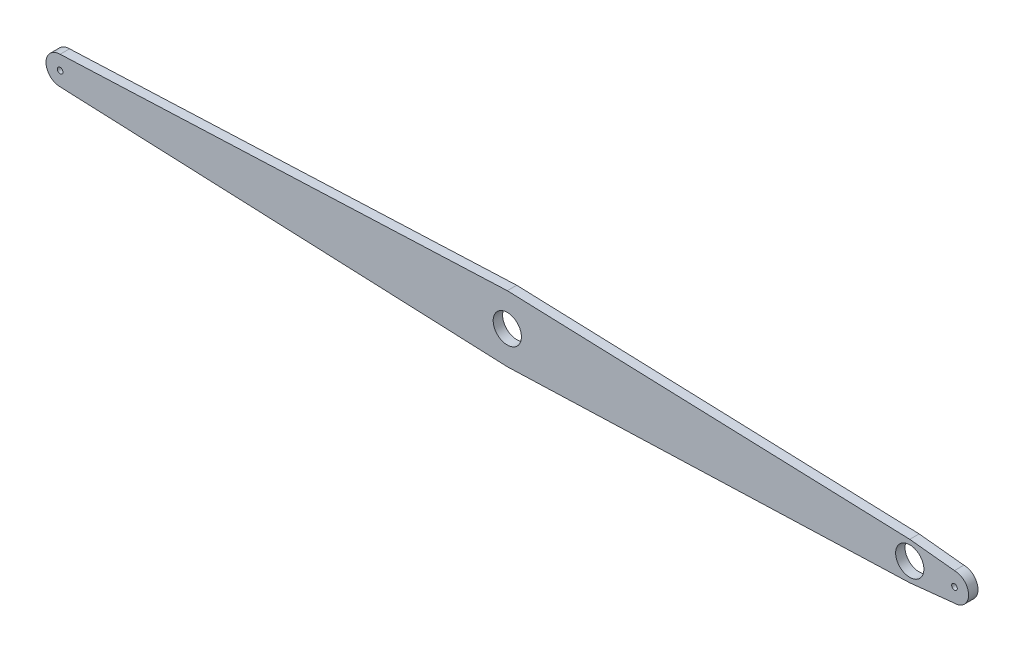
ISO-10303-21;
HEADER;
FILE_DESCRIPTION(('STEP AP214'),'2;1');
FILE_NAME('part.step','',(''),(''),'','','');
FILE_SCHEMA(('AUTOMOTIVE_DESIGN { 1 0 10303 214 1 1 1 1 }'));
ENDSEC;
DATA;
#1=APPLICATION_CONTEXT('core data for automotive mechanical design processes');
#2=APPLICATION_PROTOCOL_DEFINITION('international standard','automotive_design',2000,#1);
#3=PRODUCT_CONTEXT('',#1,'mechanical');
#4=PRODUCT('Part','Part','',(#3));
#5=PRODUCT_RELATED_PRODUCT_CATEGORY('part','',(#4));
#6=PRODUCT_DEFINITION_FORMATION('','',#4);
#7=PRODUCT_DEFINITION_CONTEXT('part definition',#1,'design');
#8=PRODUCT_DEFINITION('design','',#6,#7);
#9=PRODUCT_DEFINITION_SHAPE('','',#8);
#10=(LENGTH_UNIT() NAMED_UNIT(*) SI_UNIT(.MILLI.,.METRE.));
#11=(NAMED_UNIT(*) PLANE_ANGLE_UNIT() SI_UNIT($,.RADIAN.));
#12=(NAMED_UNIT(*) SI_UNIT($,.STERADIAN.) SOLID_ANGLE_UNIT());
#13=UNCERTAINTY_MEASURE_WITH_UNIT(LENGTH_MEASURE(1.E-05),#10,'distance_accuracy_value','');
#14=(GEOMETRIC_REPRESENTATION_CONTEXT(3) GLOBAL_UNCERTAINTY_ASSIGNED_CONTEXT((#13)) GLOBAL_UNIT_ASSIGNED_CONTEXT((#10,
#11,#12)) REPRESENTATION_CONTEXT('',''));
#15=CARTESIAN_POINT('',(0.,0.,0.));
#16=DIRECTION('',(0.,0.,1.));
#17=DIRECTION('',(1.,0.,0.));
#18=AXIS2_PLACEMENT_3D('',#15,#16,#17);
#19=CARTESIAN_POINT('',(-1900.,0.,20.));
#20=DIRECTION('',(0.,0.,-1.));
#21=DIRECTION('',(-1.,0.,0.));
#22=AXIS2_PLACEMENT_3D('',#19,#20,#21);
#23=PLANE('',#22);
#24=CARTESIAN_POINT('',(-1900.,0.,20.));
#25=DIRECTION('',(0.,0.,1.));
#26=DIRECTION('',(-1.,0.,0.));
#27=AXIS2_PLACEMENT_3D('',#24,#25,#26);
#28=CIRCLE('',#27,29.9999999999998);
#29=CARTESIAN_POINT('',(-1900.,29.9999999999995,20.));
#30=VERTEX_POINT('',#29);
#31=CARTESIAN_POINT('',(-1900.,-30.,20.));
#32=VERTEX_POINT('',#31);
#33=EDGE_CURVE('E157',#30,#32,#28,.T.);
#34=ORIENTED_EDGE('',*,*,#33,.T.);
#35=DIRECTION('',(0.999114750296777,-0.0420679894861799,0.));
#36=VECTOR('',#35,1.);
#37=CARTESIAN_POINT('',(-1900.,-30.,20.));
#38=LINE('',#37,#36);
#39=CARTESIAN_POINT('',(-950.,-69.9999999999999,20.));
#40=VERTEX_POINT('',#39);
#41=EDGE_CURVE('E105',#32,#40,#38,.T.);
#42=ORIENTED_EDGE('',*,*,#41,.T.);
#43=DIRECTION('',(0.999384993791767,0.0350661401330443,0.));
#44=VECTOR('',#43,1.);
#45=CARTESIAN_POINT('',(-950.,-69.9999999999999,20.));
#46=LINE('',#45,#44);
#47=CARTESIAN_POINT('',(-95.,-40.,20.));
#48=VERTEX_POINT('',#47);
#49=EDGE_CURVE('E172',#40,#48,#46,.T.);
#50=ORIENTED_EDGE('',*,*,#49,.T.);
#51=DIRECTION('',(0.994505452921406,0.104684784518043,0.));
#52=VECTOR('',#51,1.);
#53=CARTESIAN_POINT('',(-95.,-40.,20.));
#54=LINE('',#53,#52);
#55=CARTESIAN_POINT('',(0.,-30.,20.));
#56=VERTEX_POINT('',#55);
#57=EDGE_CURVE('E185',#48,#56,#54,.T.);
#58=ORIENTED_EDGE('',*,*,#57,.T.);
#59=CARTESIAN_POINT('',(0.,0.,20.));
#60=DIRECTION('',(0.,0.,1.));
#61=DIRECTION('',(1.,0.,0.));
#62=AXIS2_PLACEMENT_3D('',#59,#60,#61);
#63=CIRCLE('',#62,30.);
#64=CARTESIAN_POINT('',(0.,30.,20.));
#65=VERTEX_POINT('',#64);
#66=EDGE_CURVE('E124',#56,#65,#63,.T.);
#67=ORIENTED_EDGE('',*,*,#66,.T.);
#68=DIRECTION('',(-0.994505452921406,0.104684784518043,0.));
#69=VECTOR('',#68,1.);
#70=CARTESIAN_POINT('',(-95.,40.,20.));
#71=LINE('',#70,#69);
#72=CARTESIAN_POINT('',(-95.,40.,20.));
#73=VERTEX_POINT('',#72);
#74=EDGE_CURVE('E118',#65,#73,#71,.T.);
#75=ORIENTED_EDGE('',*,*,#74,.T.);
#76=DIRECTION('',(-0.999384993791767,0.0350661401330443,0.));
#77=VECTOR('',#76,1.);
#78=CARTESIAN_POINT('',(-950.,69.9999999999999,20.));
#79=LINE('',#78,#77);
#80=CARTESIAN_POINT('',(-950.,69.9999999999999,20.));
#81=VERTEX_POINT('',#80);
#82=EDGE_CURVE('E122',#73,#81,#79,.T.);
#83=ORIENTED_EDGE('',*,*,#82,.T.);
#84=DIRECTION('',(-0.999114750296777,-0.0420679894861804,0.));
#85=VECTOR('',#84,1.);
#86=CARTESIAN_POINT('',(-1900.,29.9999999999995,20.));
#87=LINE('',#86,#85);
#88=EDGE_CURVE('E62',#81,#30,#87,.T.);
#89=ORIENTED_EDGE('',*,*,#88,.T.);
#90=EDGE_LOOP('',(#34,#42,#50,#58,#67,#75,#83,#89));
#91=FACE_BOUND('',#90,.T.);
#92=CARTESIAN_POINT('',(-950.,-1.16341445918999E-13,20.));
#93=DIRECTION('',(0.,0.,1.));
#94=DIRECTION('',(1.,0.,0.));
#95=AXIS2_PLACEMENT_3D('',#92,#93,#94);
#96=CIRCLE('',#95,30.);
#97=CARTESIAN_POINT('',(-920.,-1.16341445918999E-13,20.));
#98=VERTEX_POINT('',#97);
#99=EDGE_CURVE('E146',#98,#98,#96,.T.);
#100=ORIENTED_EDGE('',*,*,#99,.F.);
#101=EDGE_LOOP('',(#100));
#102=FACE_BOUND('',#101,.T.);
#103=CARTESIAN_POINT('',(-1900.,0.,20.));
#104=DIRECTION('',(0.,0.,1.));
#105=DIRECTION('',(1.,0.,0.));
#106=AXIS2_PLACEMENT_3D('',#103,#104,#105);
#107=CIRCLE('',#106,6.0000000000001);
#108=CARTESIAN_POINT('',(-1894.,0.,20.));
#109=VERTEX_POINT('',#108);
#110=EDGE_CURVE('E194',#109,#109,#107,.T.);
#111=ORIENTED_EDGE('',*,*,#110,.F.);
#112=EDGE_LOOP('',(#111));
#113=FACE_BOUND('',#112,.T.);
#114=CARTESIAN_POINT('',(0.,0.,20.));
#115=DIRECTION('',(0.,0.,1.));
#116=DIRECTION('',(1.,0.,0.));
#117=AXIS2_PLACEMENT_3D('',#114,#115,#116);
#118=CIRCLE('',#117,6.);
#119=CARTESIAN_POINT('',(6.,0.,20.));
#120=VERTEX_POINT('',#119);
#121=EDGE_CURVE('E200',#120,#120,#118,.T.);
#122=ORIENTED_EDGE('',*,*,#121,.F.);
#123=EDGE_LOOP('',(#122));
#124=FACE_BOUND('',#123,.T.);
#125=CARTESIAN_POINT('',(-94.9999999999999,0.,20.));
#126=DIRECTION('',(0.,0.,1.));
#127=DIRECTION('',(1.,0.,0.));
#128=AXIS2_PLACEMENT_3D('',#125,#126,#127);
#129=CIRCLE('',#128,30.);
#130=CARTESIAN_POINT('',(-64.9999999999999,0.,20.));
#131=VERTEX_POINT('',#130);
#132=EDGE_CURVE('E206',#131,#131,#129,.T.);
#133=ORIENTED_EDGE('',*,*,#132,.F.);
#134=EDGE_LOOP('',(#133));
#135=FACE_BOUND('',#134,.T.);
#136=ADVANCED_FACE('F45',(#91,#102,#113,#124,#135),#23,.F.);
#137=CARTESIAN_POINT('',(-1900.,0.,0.));
#138=DIRECTION('',(0.,0.,-1.));
#139=DIRECTION('',(-1.,0.,0.));
#140=AXIS2_PLACEMENT_3D('',#137,#138,#139);
#141=PLANE('',#140);
#142=CARTESIAN_POINT('',(0.,0.,0.));
#143=DIRECTION('',(0.,0.,1.));
#144=DIRECTION('',(1.,0.,0.));
#145=AXIS2_PLACEMENT_3D('',#142,#143,#144);
#146=CIRCLE('',#145,6.);
#147=CARTESIAN_POINT('',(6.,0.,0.));
#148=VERTEX_POINT('',#147);
#149=EDGE_CURVE('E203',#148,#148,#146,.T.);
#150=ORIENTED_EDGE('',*,*,#149,.T.);
#151=EDGE_LOOP('',(#150));
#152=FACE_BOUND('',#151,.T.);
#153=CARTESIAN_POINT('',(-950.,-1.16341445918999E-13,0.));
#154=DIRECTION('',(0.,0.,1.));
#155=DIRECTION('',(1.,0.,0.));
#156=AXIS2_PLACEMENT_3D('',#153,#154,#155);
#157=CIRCLE('',#156,30.);
#158=CARTESIAN_POINT('',(-920.,-1.16341445918999E-13,0.));
#159=VERTEX_POINT('',#158);
#160=EDGE_CURVE('E191',#159,#159,#157,.T.);
#161=ORIENTED_EDGE('',*,*,#160,.T.);
#162=EDGE_LOOP('',(#161));
#163=FACE_BOUND('',#162,.T.);
#164=CARTESIAN_POINT('',(-1900.,0.,0.));
#165=DIRECTION('',(0.,0.,1.));
#166=DIRECTION('',(-1.,0.,0.));
#167=AXIS2_PLACEMENT_3D('',#164,#165,#166);
#168=CIRCLE('',#167,29.9999999999998);
#169=CARTESIAN_POINT('',(-1900.,29.9999999999995,0.));
#170=VERTEX_POINT('',#169);
#171=CARTESIAN_POINT('',(-1900.,-30.,0.));
#172=VERTEX_POINT('',#171);
#173=EDGE_CURVE('E142',#170,#172,#168,.T.);
#174=ORIENTED_EDGE('',*,*,#173,.F.);
#175=DIRECTION('',(-0.999114750296777,-0.0420679894861804,0.));
#176=VECTOR('',#175,1.);
#177=CARTESIAN_POINT('',(-1900.,29.9999999999995,0.));
#178=LINE('',#177,#176);
#179=CARTESIAN_POINT('',(-950.,69.9999999999999,0.));
#180=VERTEX_POINT('',#179);
#181=EDGE_CURVE('E97',#180,#170,#178,.T.);
#182=ORIENTED_EDGE('',*,*,#181,.F.);
#183=DIRECTION('',(-0.999384993791767,0.0350661401330443,0.));
#184=VECTOR('',#183,1.);
#185=CARTESIAN_POINT('',(-950.,69.9999999999999,0.));
#186=LINE('',#185,#184);
#187=CARTESIAN_POINT('',(-95.,40.,0.));
#188=VERTEX_POINT('',#187);
#189=EDGE_CURVE('E91',#188,#180,#186,.T.);
#190=ORIENTED_EDGE('',*,*,#189,.F.);
#191=DIRECTION('',(-0.994505452921406,0.104684784518043,0.));
#192=VECTOR('',#191,1.);
#193=CARTESIAN_POINT('',(-95.,40.,0.));
#194=LINE('',#193,#192);
#195=CARTESIAN_POINT('',(0.,30.,0.));
#196=VERTEX_POINT('',#195);
#197=EDGE_CURVE('E132',#196,#188,#194,.T.);
#198=ORIENTED_EDGE('',*,*,#197,.F.);
#199=CARTESIAN_POINT('',(0.,0.,0.));
#200=DIRECTION('',(0.,0.,1.));
#201=DIRECTION('',(1.,0.,0.));
#202=AXIS2_PLACEMENT_3D('',#199,#200,#201);
#203=CIRCLE('',#202,30.);
#204=CARTESIAN_POINT('',(0.,-30.,0.));
#205=VERTEX_POINT('',#204);
#206=EDGE_CURVE('E152',#205,#196,#203,.T.);
#207=ORIENTED_EDGE('',*,*,#206,.F.);
#208=DIRECTION('',(0.994505452921406,0.104684784518043,0.));
#209=VECTOR('',#208,1.);
#210=CARTESIAN_POINT('',(-95.,-40.,0.));
#211=LINE('',#210,#209);
#212=CARTESIAN_POINT('',(-95.,-40.,0.));
#213=VERTEX_POINT('',#212);
#214=EDGE_CURVE('E150',#213,#205,#211,.T.);
#215=ORIENTED_EDGE('',*,*,#214,.F.);
#216=DIRECTION('',(0.999384993791767,0.0350661401330443,0.));
#217=VECTOR('',#216,1.);
#218=CARTESIAN_POINT('',(-950.,-69.9999999999999,0.));
#219=LINE('',#218,#217);
#220=CARTESIAN_POINT('',(-950.,-69.9999999999999,0.));
#221=VERTEX_POINT('',#220);
#222=EDGE_CURVE('E148',#221,#213,#219,.T.);
#223=ORIENTED_EDGE('',*,*,#222,.F.);
#224=DIRECTION('',(0.999114750296777,-0.0420679894861799,0.));
#225=VECTOR('',#224,1.);
#226=CARTESIAN_POINT('',(-1900.,-30.,0.));
#227=LINE('',#226,#225);
#228=EDGE_CURVE('E145',#172,#221,#227,.T.);
#229=ORIENTED_EDGE('',*,*,#228,.F.);
#230=EDGE_LOOP('',(#174,#182,#190,#198,#207,#215,#223,#229));
#231=FACE_BOUND('',#230,.T.);
#232=CARTESIAN_POINT('',(-1900.,0.,0.));
#233=DIRECTION('',(0.,0.,1.));
#234=DIRECTION('',(1.,0.,0.));
#235=AXIS2_PLACEMENT_3D('',#232,#233,#234);
#236=CIRCLE('',#235,6.0000000000001);
#237=CARTESIAN_POINT('',(-1894.,0.,0.));
#238=VERTEX_POINT('',#237);
#239=EDGE_CURVE('E197',#238,#238,#236,.T.);
#240=ORIENTED_EDGE('',*,*,#239,.T.);
#241=EDGE_LOOP('',(#240));
#242=FACE_BOUND('',#241,.T.);
#243=CARTESIAN_POINT('',(-94.9999999999999,0.,0.));
#244=DIRECTION('',(0.,0.,1.));
#245=DIRECTION('',(1.,0.,0.));
#246=AXIS2_PLACEMENT_3D('',#243,#244,#245);
#247=CIRCLE('',#246,30.);
#248=CARTESIAN_POINT('',(-64.9999999999999,0.,0.));
#249=VERTEX_POINT('',#248);
#250=EDGE_CURVE('E209',#249,#249,#247,.T.);
#251=ORIENTED_EDGE('',*,*,#250,.T.);
#252=EDGE_LOOP('',(#251));
#253=FACE_BOUND('',#252,.T.);
#254=ADVANCED_FACE('F176',(#152,#163,#231,#242,#253),#141,.T.);
#255=CARTESIAN_POINT('',(-1900.,0.,20.));
#256=DIRECTION('',(0.,0.,-1.));
#257=DIRECTION('',(-1.,0.,0.));
#258=AXIS2_PLACEMENT_3D('',#255,#256,#257);
#259=CYLINDRICAL_SURFACE('',#258,29.9999999999998);
#260=ORIENTED_EDGE('',*,*,#173,.T.);
#261=DIRECTION('',(0.,0.,-1.));
#262=VECTOR('',#261,1.);
#263=CARTESIAN_POINT('',(-1900.,-30.,20.));
#264=LINE('',#263,#262);
#265=EDGE_CURVE('E13',#32,#172,#264,.T.);
#266=ORIENTED_EDGE('',*,*,#265,.F.);
#267=ORIENTED_EDGE('',*,*,#33,.F.);
#268=DIRECTION('',(0.,0.,-1.));
#269=VECTOR('',#268,1.);
#270=CARTESIAN_POINT('',(-1900.,29.9999999999995,20.));
#271=LINE('',#270,#269);
#272=EDGE_CURVE('E138',#30,#170,#271,.T.);
#273=ORIENTED_EDGE('',*,*,#272,.T.);
#274=EDGE_LOOP('',(#260,#266,#267,#273));
#275=FACE_BOUND('',#274,.T.);
#276=ADVANCED_FACE('F47',(#275),#259,.T.);
#277=CARTESIAN_POINT('',(-1900.,-30.,20.));
#278=DIRECTION('',(0.0420679894861799,0.999114750296777,0.));
#279=DIRECTION('',(-0.999114750296777,0.0420679894861799,0.));
#280=AXIS2_PLACEMENT_3D('',#277,#278,#279);
#281=PLANE('',#280);
#282=ORIENTED_EDGE('',*,*,#228,.T.);
#283=DIRECTION('',(0.,0.,-1.));
#284=VECTOR('',#283,1.);
#285=CARTESIAN_POINT('',(-950.,-69.9999999999999,20.));
#286=LINE('',#285,#284);
#287=EDGE_CURVE('E54',#40,#221,#286,.T.);
#288=ORIENTED_EDGE('',*,*,#287,.F.);
#289=ORIENTED_EDGE('',*,*,#41,.F.);
#290=ORIENTED_EDGE('',*,*,#265,.T.);
#291=EDGE_LOOP('',(#282,#288,#289,#290));
#292=FACE_BOUND('',#291,.T.);
#293=ADVANCED_FACE('F241',(#292),#281,.F.);
#294=CARTESIAN_POINT('',(-950.,-69.9999999999999,20.));
#295=DIRECTION('',(-0.0350661401330443,0.999384993791767,0.));
#296=DIRECTION('',(-0.999384993791767,-0.0350661401330443,0.));
#297=AXIS2_PLACEMENT_3D('',#294,#295,#296);
#298=PLANE('',#297);
#299=ORIENTED_EDGE('',*,*,#222,.T.);
#300=DIRECTION('',(0.,0.,-1.));
#301=VECTOR('',#300,1.);
#302=CARTESIAN_POINT('',(-95.,-40.,20.));
#303=LINE('',#302,#301);
#304=EDGE_CURVE('E164',#48,#213,#303,.T.);
#305=ORIENTED_EDGE('',*,*,#304,.F.);
#306=ORIENTED_EDGE('',*,*,#49,.F.);
#307=ORIENTED_EDGE('',*,*,#287,.T.);
#308=EDGE_LOOP('',(#299,#305,#306,#307));
#309=FACE_BOUND('',#308,.T.);
#310=ADVANCED_FACE('F170',(#309),#298,.F.);
#311=CARTESIAN_POINT('',(-95.,-40.,20.));
#312=DIRECTION('',(-0.104684784518043,0.994505452921406,0.));
#313=DIRECTION('',(-0.994505452921406,-0.104684784518043,0.));
#314=AXIS2_PLACEMENT_3D('',#311,#312,#313);
#315=PLANE('',#314);
#316=ORIENTED_EDGE('',*,*,#214,.T.);
#317=DIRECTION('',(0.,0.,-1.));
#318=VECTOR('',#317,1.);
#319=CARTESIAN_POINT('',(0.,-30.,20.));
#320=LINE('',#319,#318);
#321=EDGE_CURVE('E161',#56,#205,#320,.T.);
#322=ORIENTED_EDGE('',*,*,#321,.F.);
#323=ORIENTED_EDGE('',*,*,#57,.F.);
#324=ORIENTED_EDGE('',*,*,#304,.T.);
#325=EDGE_LOOP('',(#316,#322,#323,#324));
#326=FACE_BOUND('',#325,.T.);
#327=ADVANCED_FACE('F181',(#326),#315,.F.);
#328=CARTESIAN_POINT('',(0.,0.,20.));
#329=DIRECTION('',(0.,0.,-1.));
#330=DIRECTION('',(-1.,0.,0.));
#331=AXIS2_PLACEMENT_3D('',#328,#329,#330);
#332=CYLINDRICAL_SURFACE('',#331,30.);
#333=ORIENTED_EDGE('',*,*,#206,.T.);
#334=DIRECTION('',(0.,0.,-1.));
#335=VECTOR('',#334,1.);
#336=CARTESIAN_POINT('',(0.,30.,20.));
#337=LINE('',#336,#335);
#338=EDGE_CURVE('E133',#65,#196,#337,.T.);
#339=ORIENTED_EDGE('',*,*,#338,.F.);
#340=ORIENTED_EDGE('',*,*,#66,.F.);
#341=ORIENTED_EDGE('',*,*,#321,.T.);
#342=EDGE_LOOP('',(#333,#339,#340,#341));
#343=FACE_BOUND('',#342,.T.);
#344=ADVANCED_FACE('F184',(#343),#332,.T.);
#345=CARTESIAN_POINT('',(-95.,40.,20.));
#346=DIRECTION('',(-0.104684784518043,-0.994505452921406,0.));
#347=DIRECTION('',(0.994505452921406,-0.104684784518043,0.));
#348=AXIS2_PLACEMENT_3D('',#345,#346,#347);
#349=PLANE('',#348);
#350=ORIENTED_EDGE('',*,*,#197,.T.);
#351=DIRECTION('',(0.,0.,-1.));
#352=VECTOR('',#351,1.);
#353=CARTESIAN_POINT('',(-95.,40.,20.));
#354=LINE('',#353,#352);
#355=EDGE_CURVE('E129',#73,#188,#354,.T.);
#356=ORIENTED_EDGE('',*,*,#355,.F.);
#357=ORIENTED_EDGE('',*,*,#74,.F.);
#358=ORIENTED_EDGE('',*,*,#338,.T.);
#359=EDGE_LOOP('',(#350,#356,#357,#358));
#360=FACE_BOUND('',#359,.T.);
#361=ADVANCED_FACE('F130',(#360),#349,.F.);
#362=CARTESIAN_POINT('',(-950.,69.9999999999999,20.));
#363=DIRECTION('',(-0.0350661401330443,-0.999384993791767,0.));
#364=DIRECTION('',(0.999384993791767,-0.0350661401330443,0.));
#365=AXIS2_PLACEMENT_3D('',#362,#363,#364);
#366=PLANE('',#365);
#367=ORIENTED_EDGE('',*,*,#189,.T.);
#368=DIRECTION('',(0.,0.,-1.));
#369=VECTOR('',#368,1.);
#370=CARTESIAN_POINT('',(-950.,69.9999999999999,20.));
#371=LINE('',#370,#369);
#372=EDGE_CURVE('E134',#81,#180,#371,.T.);
#373=ORIENTED_EDGE('',*,*,#372,.F.);
#374=ORIENTED_EDGE('',*,*,#82,.F.);
#375=ORIENTED_EDGE('',*,*,#355,.T.);
#376=EDGE_LOOP('',(#367,#373,#374,#375));
#377=FACE_BOUND('',#376,.T.);
#378=ADVANCED_FACE('F136',(#377),#366,.F.);
#379=CARTESIAN_POINT('',(-1900.,29.9999999999995,20.));
#380=DIRECTION('',(0.0420679894861804,-0.999114750296777,0.));
#381=DIRECTION('',(0.999114750296777,0.0420679894861804,0.));
#382=AXIS2_PLACEMENT_3D('',#379,#380,#381);
#383=PLANE('',#382);
#384=ORIENTED_EDGE('',*,*,#181,.T.);
#385=ORIENTED_EDGE('',*,*,#272,.F.);
#386=ORIENTED_EDGE('',*,*,#88,.F.);
#387=ORIENTED_EDGE('',*,*,#372,.T.);
#388=EDGE_LOOP('',(#384,#385,#386,#387));
#389=FACE_BOUND('',#388,.T.);
#390=ADVANCED_FACE('F229',(#389),#383,.F.);
#391=CARTESIAN_POINT('',(-950.,-1.16341445918999E-13,20.));
#392=DIRECTION('',(0.,0.,-1.));
#393=DIRECTION('',(-1.,0.,0.));
#394=AXIS2_PLACEMENT_3D('',#391,#392,#393);
#395=CYLINDRICAL_SURFACE('',#394,30.);
#396=ORIENTED_EDGE('',*,*,#99,.T.);
#397=EDGE_LOOP('',(#396));
#398=FACE_BOUND('',#397,.T.);
#399=ORIENTED_EDGE('',*,*,#160,.F.);
#400=EDGE_LOOP('',(#399));
#401=FACE_BOUND('',#400,.T.);
#402=ADVANCED_FACE('F226',(#398,#401),#395,.F.);
#403=CARTESIAN_POINT('',(-1900.,0.,20.));
#404=DIRECTION('',(0.,0.,-1.));
#405=DIRECTION('',(-1.,0.,0.));
#406=AXIS2_PLACEMENT_3D('',#403,#404,#405);
#407=CYLINDRICAL_SURFACE('',#406,6.0000000000001);
#408=ORIENTED_EDGE('',*,*,#110,.T.);
#409=EDGE_LOOP('',(#408));
#410=FACE_BOUND('',#409,.T.);
#411=ORIENTED_EDGE('',*,*,#239,.F.);
#412=EDGE_LOOP('',(#411));
#413=FACE_BOUND('',#412,.T.);
#414=ADVANCED_FACE('F305',(#410,#413),#407,.F.);
#415=CARTESIAN_POINT('',(0.,0.,20.));
#416=DIRECTION('',(0.,0.,-1.));
#417=DIRECTION('',(-1.,0.,0.));
#418=AXIS2_PLACEMENT_3D('',#415,#416,#417);
#419=CYLINDRICAL_SURFACE('',#418,6.);
#420=ORIENTED_EDGE('',*,*,#121,.T.);
#421=EDGE_LOOP('',(#420));
#422=FACE_BOUND('',#421,.T.);
#423=ORIENTED_EDGE('',*,*,#149,.F.);
#424=EDGE_LOOP('',(#423));
#425=FACE_BOUND('',#424,.T.);
#426=ADVANCED_FACE('F313',(#422,#425),#419,.F.);
#427=CARTESIAN_POINT('',(-94.9999999999999,0.,20.));
#428=DIRECTION('',(0.,0.,-1.));
#429=DIRECTION('',(-1.,0.,0.));
#430=AXIS2_PLACEMENT_3D('',#427,#428,#429);
#431=CYLINDRICAL_SURFACE('',#430,30.);
#432=ORIENTED_EDGE('',*,*,#132,.T.);
#433=EDGE_LOOP('',(#432));
#434=FACE_BOUND('',#433,.T.);
#435=ORIENTED_EDGE('',*,*,#250,.F.);
#436=EDGE_LOOP('',(#435));
#437=FACE_BOUND('',#436,.T.);
#438=ADVANCED_FACE('F215',(#434,#437),#431,.F.);
#439=CLOSED_SHELL('',(#136,#254,#276,#293,#310,#327,#344,#361,#378,#390,#402,#414,#426,#438));
#440=MANIFOLD_SOLID_BREP('B2',#439);
#441=ADVANCED_BREP_SHAPE_REPRESENTATION('',(#18,#440),#14);
#442=SHAPE_DEFINITION_REPRESENTATION(#9,#441);
ENDSEC;
END-ISO-10303-21;
